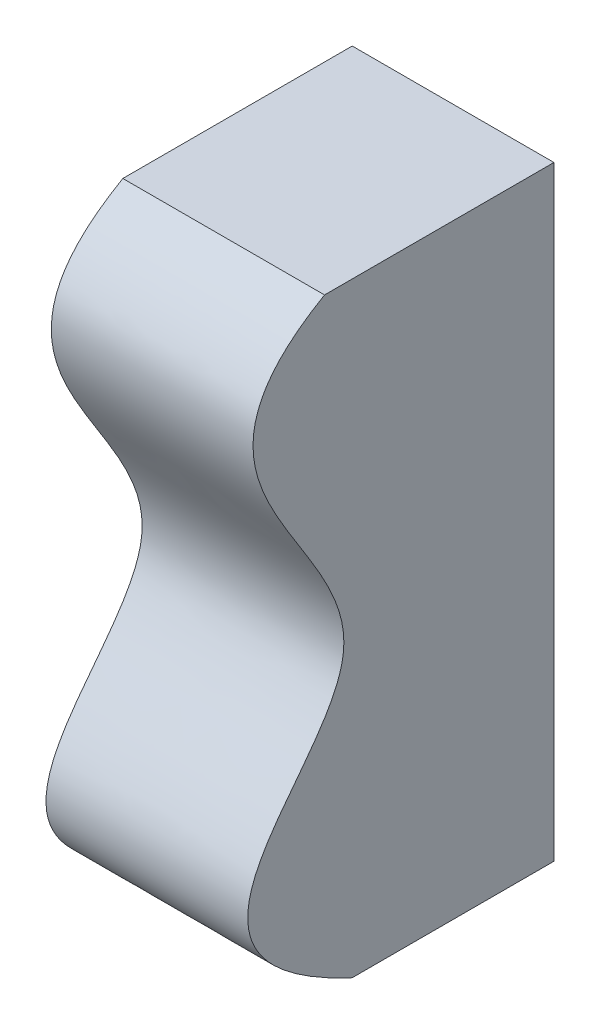
ISO-10303-21;
HEADER;
FILE_DESCRIPTION(('STEP AP214'),'2;1');
FILE_NAME('part.step','',(''),(''),'','','');
FILE_SCHEMA(('AUTOMOTIVE_DESIGN { 1 0 10303 214 1 1 1 1 }'));
ENDSEC;
DATA;
#1=APPLICATION_CONTEXT('core data for automotive mechanical design processes');
#2=APPLICATION_PROTOCOL_DEFINITION('international standard','automotive_design',2000,#1);
#3=PRODUCT_CONTEXT('',#1,'mechanical');
#4=PRODUCT('Part','Part','',(#3));
#5=PRODUCT_RELATED_PRODUCT_CATEGORY('part','',(#4));
#6=PRODUCT_DEFINITION_FORMATION('','',#4);
#7=PRODUCT_DEFINITION_CONTEXT('part definition',#1,'design');
#8=PRODUCT_DEFINITION('design','',#6,#7);
#9=PRODUCT_DEFINITION_SHAPE('','',#8);
#10=(LENGTH_UNIT() NAMED_UNIT(*) SI_UNIT(.MILLI.,.METRE.));
#11=(NAMED_UNIT(*) PLANE_ANGLE_UNIT() SI_UNIT($,.RADIAN.));
#12=(NAMED_UNIT(*) SI_UNIT($,.STERADIAN.) SOLID_ANGLE_UNIT());
#13=UNCERTAINTY_MEASURE_WITH_UNIT(LENGTH_MEASURE(1.E-05),#10,'distance_accuracy_value','');
#14=(GEOMETRIC_REPRESENTATION_CONTEXT(3) GLOBAL_UNCERTAINTY_ASSIGNED_CONTEXT((#13)) GLOBAL_UNIT_ASSIGNED_CONTEXT((#10,
#11,#12)) REPRESENTATION_CONTEXT('',''));
#15=CARTESIAN_POINT('',(0.,0.,0.));
#16=DIRECTION('',(0.,0.,1.));
#17=DIRECTION('',(1.,0.,0.));
#18=AXIS2_PLACEMENT_3D('',#15,#16,#17);
#19=CARTESIAN_POINT('',(2.54,7.62,0.348694481830418));
#20=CARTESIAN_POINT('',(2.54,6.33493882570468,2.57640642635447));
#21=CARTESIAN_POINT('',(2.54,3.54988622650035,-2.48529034933791));
#22=CARTESIAN_POINT('',(2.54,1.30871273598274,2.81202933479796));
#23=CARTESIAN_POINT('',(2.54,0.,0.));
#24=B_SPLINE_CURVE_WITH_KNOTS('',3,(#19,#20,#21,#22,#23),.UNSPECIFIED.,.F.,.F.,(4,1,4),(0.,
0.519210177040176,1.),.UNSPECIFIED.);
#25=DIRECTION('',(-1.,0.,0.));
#26=VECTOR('',#25,1.);
#27=SURFACE_OF_LINEAR_EXTRUSION('',#24,#26);
#28=CARTESIAN_POINT('',(0.,7.62,0.348694481830418));
#29=CARTESIAN_POINT('',(0.,6.33493882570468,2.57640642635447));
#30=CARTESIAN_POINT('',(0.,3.54988622650035,-2.48529034933791));
#31=CARTESIAN_POINT('',(0.,1.30871273598274,2.81202933479796));
#32=CARTESIAN_POINT('',(0.,0.,0.));
#33=B_SPLINE_CURVE_WITH_KNOTS('',3,(#28,#29,#30,#31,#32),.UNSPECIFIED.,.F.,.F.,(4,1,4),(0.,
0.519210177040176,1.),.UNSPECIFIED.);
#34=CARTESIAN_POINT('',(0.,7.62,0.348694481830418));
#35=VERTEX_POINT('',#34);
#36=CARTESIAN_POINT('',(0.,0.,0.));
#37=VERTEX_POINT('',#36);
#38=EDGE_CURVE('E113',#35,#37,#33,.T.);
#39=ORIENTED_EDGE('',*,*,#38,.T.);
#40=DIRECTION('',(-1.,0.,0.));
#41=VECTOR('',#40,1.);
#42=CARTESIAN_POINT('',(2.54,0.,0.));
#43=LINE('',#42,#41);
#44=CARTESIAN_POINT('',(2.54,0.,0.));
#45=VERTEX_POINT('',#44);
#46=EDGE_CURVE('E11',#45,#37,#43,.T.);
#47=ORIENTED_EDGE('',*,*,#46,.F.);
#48=CARTESIAN_POINT('',(2.54,7.62,0.348694481830418));
#49=VERTEX_POINT('',#48);
#50=EDGE_CURVE('E98',#49,#45,#24,.T.);
#51=ORIENTED_EDGE('',*,*,#50,.F.);
#52=DIRECTION('',(-1.,0.,0.));
#53=VECTOR('',#52,1.);
#54=CARTESIAN_POINT('',(2.54,7.62,0.348694481830418));
#55=LINE('',#54,#53);
#56=EDGE_CURVE('E110',#49,#35,#55,.T.);
#57=ORIENTED_EDGE('',*,*,#56,.T.);
#58=EDGE_LOOP('',(#39,#47,#51,#57));
#59=FACE_BOUND('',#58,.T.);
#60=ADVANCED_FACE('F45',(#59),#27,.F.);
#61=CARTESIAN_POINT('',(2.54,0.,0.));
#62=DIRECTION('',(0.,1.,0.));
#63=DIRECTION('',(0.,0.,1.));
#64=AXIS2_PLACEMENT_3D('',#61,#62,#63);
#65=PLANE('',#64);
#66=DIRECTION('',(0.,0.,-1.));
#67=VECTOR('',#66,1.);
#68=CARTESIAN_POINT('',(0.,0.,0.));
#69=LINE('',#68,#67);
#70=CARTESIAN_POINT('',(0.,0.,-2.54));
#71=VERTEX_POINT('',#70);
#72=EDGE_CURVE('E103',#37,#71,#69,.T.);
#73=ORIENTED_EDGE('',*,*,#72,.T.);
#74=DIRECTION('',(-1.,0.,0.));
#75=VECTOR('',#74,1.);
#76=CARTESIAN_POINT('',(2.54,0.,-2.54));
#77=LINE('',#76,#75);
#78=CARTESIAN_POINT('',(2.54,0.,-2.54));
#79=VERTEX_POINT('',#78);
#80=EDGE_CURVE('E55',#79,#71,#77,.T.);
#81=ORIENTED_EDGE('',*,*,#80,.F.);
#82=DIRECTION('',(0.,0.,-1.));
#83=VECTOR('',#82,1.);
#84=CARTESIAN_POINT('',(2.54,0.,0.));
#85=LINE('',#84,#83);
#86=EDGE_CURVE('E93',#45,#79,#85,.T.);
#87=ORIENTED_EDGE('',*,*,#86,.F.);
#88=ORIENTED_EDGE('',*,*,#46,.T.);
#89=EDGE_LOOP('',(#73,#81,#87,#88));
#90=FACE_BOUND('',#89,.T.);
#91=ADVANCED_FACE('F102',(#90),#65,.F.);
#92=CARTESIAN_POINT('',(2.54,0.,-2.54));
#93=DIRECTION('',(0.,0.,1.));
#94=DIRECTION('',(1.,0.,0.));
#95=AXIS2_PLACEMENT_3D('',#92,#93,#94);
#96=PLANE('',#95);
#97=DIRECTION('',(0.,1.,0.));
#98=VECTOR('',#97,1.);
#99=CARTESIAN_POINT('',(0.,0.,-2.54));
#100=LINE('',#99,#98);
#101=CARTESIAN_POINT('',(0.,7.62,-2.54));
#102=VERTEX_POINT('',#101);
#103=EDGE_CURVE('E80',#71,#102,#100,.T.);
#104=ORIENTED_EDGE('',*,*,#103,.T.);
#105=DIRECTION('',(-1.,0.,0.));
#106=VECTOR('',#105,1.);
#107=CARTESIAN_POINT('',(2.54,7.62,-2.54));
#108=LINE('',#107,#106);
#109=CARTESIAN_POINT('',(2.54,7.62,-2.54));
#110=VERTEX_POINT('',#109);
#111=EDGE_CURVE('E105',#110,#102,#108,.T.);
#112=ORIENTED_EDGE('',*,*,#111,.F.);
#113=DIRECTION('',(0.,1.,0.));
#114=VECTOR('',#113,1.);
#115=CARTESIAN_POINT('',(2.54,0.,-2.54));
#116=LINE('',#115,#114);
#117=EDGE_CURVE('E96',#79,#110,#116,.T.);
#118=ORIENTED_EDGE('',*,*,#117,.F.);
#119=ORIENTED_EDGE('',*,*,#80,.T.);
#120=EDGE_LOOP('',(#104,#112,#118,#119));
#121=FACE_BOUND('',#120,.T.);
#122=ADVANCED_FACE('F106',(#121),#96,.F.);
#123=CARTESIAN_POINT('',(2.54,7.62,-2.54));
#124=DIRECTION('',(0.,-1.,0.));
#125=DIRECTION('',(0.,0.,-1.));
#126=AXIS2_PLACEMENT_3D('',#123,#124,#125);
#127=PLANE('',#126);
#128=DIRECTION('',(0.,0.,1.));
#129=VECTOR('',#128,1.);
#130=CARTESIAN_POINT('',(0.,7.62,-2.54));
#131=LINE('',#130,#129);
#132=EDGE_CURVE('E86',#102,#35,#131,.T.);
#133=ORIENTED_EDGE('',*,*,#132,.T.);
#134=ORIENTED_EDGE('',*,*,#56,.F.);
#135=DIRECTION('',(0.,0.,1.));
#136=VECTOR('',#135,1.);
#137=CARTESIAN_POINT('',(2.54,7.62,-2.54));
#138=LINE('',#137,#136);
#139=EDGE_CURVE('E63',#110,#49,#138,.T.);
#140=ORIENTED_EDGE('',*,*,#139,.F.);
#141=ORIENTED_EDGE('',*,*,#111,.T.);
#142=EDGE_LOOP('',(#133,#134,#140,#141));
#143=FACE_BOUND('',#142,.T.);
#144=ADVANCED_FACE('F131',(#143),#127,.F.);
#145=CARTESIAN_POINT('',(2.54,3.73431847974048,0.105636007201521));
#146=DIRECTION('',(1.,0.,0.));
#147=DIRECTION('',(0.,0.,-1.));
#148=AXIS2_PLACEMENT_3D('',#145,#146,#147);
#149=PLANE('',#148);
#150=ORIENTED_EDGE('',*,*,#50,.T.);
#151=ORIENTED_EDGE('',*,*,#86,.T.);
#152=ORIENTED_EDGE('',*,*,#117,.T.);
#153=ORIENTED_EDGE('',*,*,#139,.T.);
#154=EDGE_LOOP('',(#150,#151,#152,#153));
#155=FACE_BOUND('',#154,.T.);
#156=ADVANCED_FACE('F94',(#155),#149,.T.);
#157=CARTESIAN_POINT('',(0.,3.73431847974048,0.105636007201521));
#158=DIRECTION('',(1.,0.,0.));
#159=DIRECTION('',(0.,0.,-1.));
#160=AXIS2_PLACEMENT_3D('',#157,#158,#159);
#161=PLANE('',#160);
#162=ORIENTED_EDGE('',*,*,#38,.F.);
#163=ORIENTED_EDGE('',*,*,#132,.F.);
#164=ORIENTED_EDGE('',*,*,#103,.F.);
#165=ORIENTED_EDGE('',*,*,#72,.F.);
#166=EDGE_LOOP('',(#162,#163,#164,#165));
#167=FACE_BOUND('',#166,.T.);
#168=ADVANCED_FACE('F134',(#167),#161,.F.);
#169=CLOSED_SHELL('',(#60,#91,#122,#144,#156,#168));
#170=MANIFOLD_SOLID_BREP('B2',#169);
#171=ADVANCED_BREP_SHAPE_REPRESENTATION('',(#18,#170),#14);
#172=SHAPE_DEFINITION_REPRESENTATION(#9,#171);
ENDSEC;
END-ISO-10303-21;
